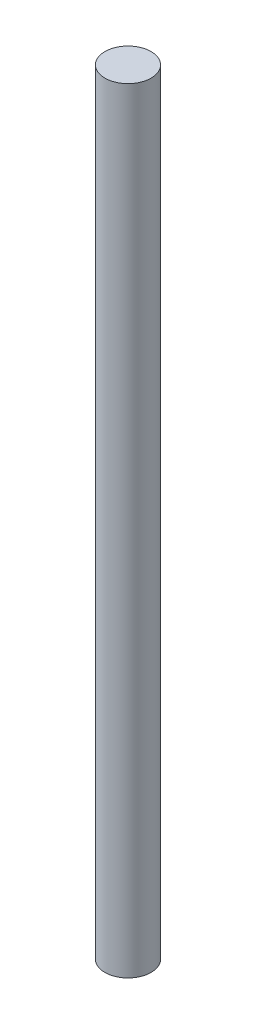
ISO-10303-21;
HEADER;
FILE_DESCRIPTION(('STEP AP214'),'2;1');
FILE_NAME('part.step','',(''),(''),'','','');
FILE_SCHEMA(('AUTOMOTIVE_DESIGN { 1 0 10303 214 1 1 1 1 }'));
ENDSEC;
DATA;
#1=APPLICATION_CONTEXT('core data for automotive mechanical design processes');
#2=APPLICATION_PROTOCOL_DEFINITION('international standard','automotive_design',2000,#1);
#3=PRODUCT_CONTEXT('',#1,'mechanical');
#4=PRODUCT('Part','Part','',(#3));
#5=PRODUCT_RELATED_PRODUCT_CATEGORY('part','',(#4));
#6=PRODUCT_DEFINITION_FORMATION('','',#4);
#7=PRODUCT_DEFINITION_CONTEXT('part definition',#1,'design');
#8=PRODUCT_DEFINITION('design','',#6,#7);
#9=PRODUCT_DEFINITION_SHAPE('','',#8);
#10=(LENGTH_UNIT() NAMED_UNIT(*) SI_UNIT(.MILLI.,.METRE.));
#11=(NAMED_UNIT(*) PLANE_ANGLE_UNIT() SI_UNIT($,.RADIAN.));
#12=(NAMED_UNIT(*) SI_UNIT($,.STERADIAN.) SOLID_ANGLE_UNIT());
#13=UNCERTAINTY_MEASURE_WITH_UNIT(LENGTH_MEASURE(1.E-05),#10,'distance_accuracy_value','');
#14=(GEOMETRIC_REPRESENTATION_CONTEXT(3) GLOBAL_UNCERTAINTY_ASSIGNED_CONTEXT((#13)) GLOBAL_UNIT_ASSIGNED_CONTEXT((#10,
#11,#12)) REPRESENTATION_CONTEXT('',''));
#15=CARTESIAN_POINT('',(0.,0.,0.));
#16=DIRECTION('',(0.,0.,1.));
#17=DIRECTION('',(1.,0.,0.));
#18=AXIS2_PLACEMENT_3D('',#15,#16,#17);
#19=CARTESIAN_POINT('',(0.,160.,0.));
#20=DIRECTION('',(0.,-1.,0.));
#21=DIRECTION('',(0.,0.,-1.));
#22=AXIS2_PLACEMENT_3D('',#19,#20,#21);
#23=CYLINDRICAL_SURFACE('',#22,4.7625);
#24=CARTESIAN_POINT('',(0.,160.,0.));
#25=DIRECTION('',(0.,1.,0.));
#26=DIRECTION('',(0.,0.,1.));
#27=AXIS2_PLACEMENT_3D('',#24,#25,#26);
#28=CIRCLE('',#27,4.7625);
#29=CARTESIAN_POINT('',(0.,160.,4.7625));
#30=VERTEX_POINT('',#29);
#31=EDGE_CURVE('E10',#30,#30,#28,.T.);
#32=ORIENTED_EDGE('',*,*,#31,.F.);
#33=EDGE_LOOP('',(#32));
#34=FACE_BOUND('',#33,.T.);
#35=CARTESIAN_POINT('',(0.,0.,0.));
#36=DIRECTION('',(0.,1.,0.));
#37=DIRECTION('',(0.,0.,1.));
#38=AXIS2_PLACEMENT_3D('',#35,#36,#37);
#39=CIRCLE('',#38,4.7625);
#40=CARTESIAN_POINT('',(0.,0.,4.7625));
#41=VERTEX_POINT('',#40);
#42=EDGE_CURVE('E34',#41,#41,#39,.T.);
#43=ORIENTED_EDGE('',*,*,#42,.T.);
#44=EDGE_LOOP('',(#43));
#45=FACE_BOUND('',#44,.T.);
#46=ADVANCED_FACE('F31',(#34,#45),#23,.T.);
#47=CARTESIAN_POINT('',(0.,160.,0.));
#48=DIRECTION('',(0.,1.,0.));
#49=DIRECTION('',(0.,0.,1.));
#50=AXIS2_PLACEMENT_3D('',#47,#48,#49);
#51=PLANE('',#50);
#52=ORIENTED_EDGE('',*,*,#31,.T.);
#53=EDGE_LOOP('',(#52));
#54=FACE_BOUND('',#53,.T.);
#55=ADVANCED_FACE('F46',(#54),#51,.T.);
#56=CARTESIAN_POINT('',(0.,0.,0.));
#57=DIRECTION('',(0.,1.,0.));
#58=DIRECTION('',(0.,0.,1.));
#59=AXIS2_PLACEMENT_3D('',#56,#57,#58);
#60=PLANE('',#59);
#61=ORIENTED_EDGE('',*,*,#42,.F.);
#62=EDGE_LOOP('',(#61));
#63=FACE_BOUND('',#62,.T.);
#64=ADVANCED_FACE('F44',(#63),#60,.F.);
#65=CLOSED_SHELL('',(#46,#55,#64));
#66=MANIFOLD_SOLID_BREP('B2',#65);
#67=ADVANCED_BREP_SHAPE_REPRESENTATION('',(#18,#66),#14);
#68=SHAPE_DEFINITION_REPRESENTATION(#9,#67);
ENDSEC;
END-ISO-10303-21;
